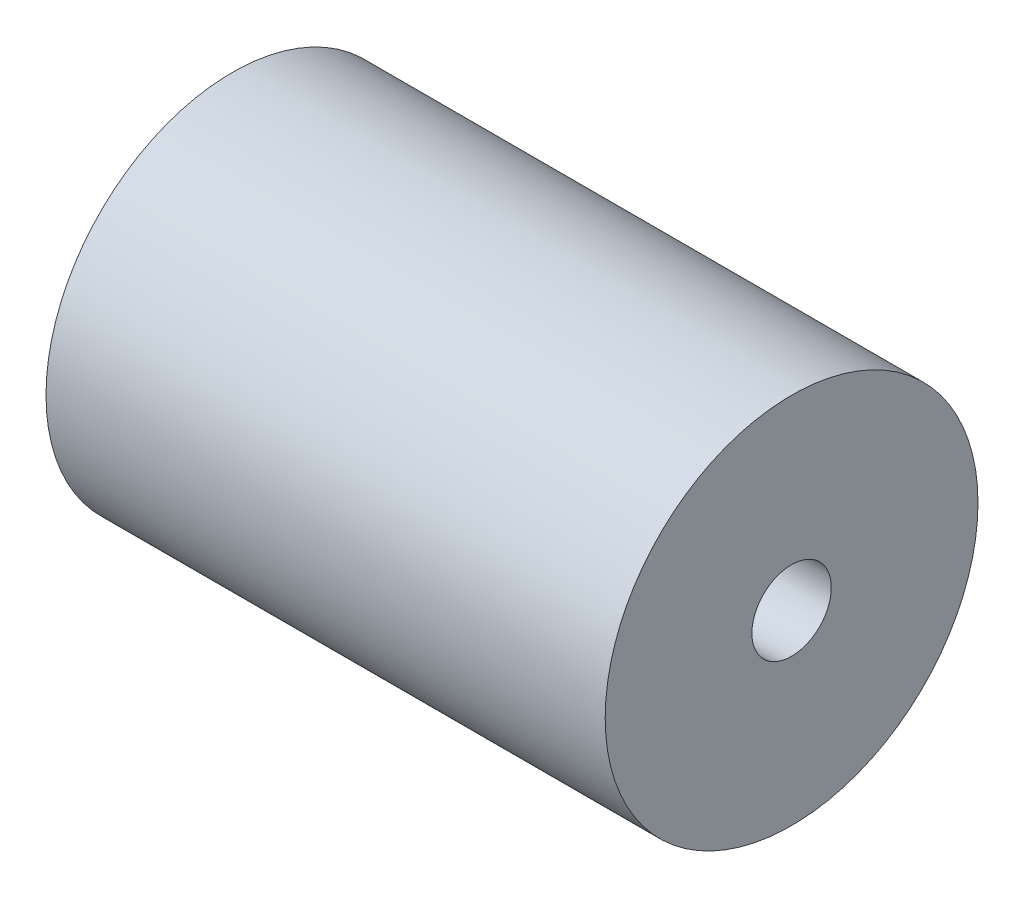
ISO-10303-21;
HEADER;
FILE_DESCRIPTION(('STEP AP214'),'2;1');
FILE_NAME('part.step','',(''),(''),'','','');
FILE_SCHEMA(('AUTOMOTIVE_DESIGN { 1 0 10303 214 1 1 1 1 }'));
ENDSEC;
DATA;
#1=APPLICATION_CONTEXT('core data for automotive mechanical design processes');
#2=APPLICATION_PROTOCOL_DEFINITION('international standard','automotive_design',2000,#1);
#3=PRODUCT_CONTEXT('',#1,'mechanical');
#4=PRODUCT('Part','Part','',(#3));
#5=PRODUCT_RELATED_PRODUCT_CATEGORY('part','',(#4));
#6=PRODUCT_DEFINITION_FORMATION('','',#4);
#7=PRODUCT_DEFINITION_CONTEXT('part definition',#1,'design');
#8=PRODUCT_DEFINITION('design','',#6,#7);
#9=PRODUCT_DEFINITION_SHAPE('','',#8);
#10=(LENGTH_UNIT() NAMED_UNIT(*) SI_UNIT(.MILLI.,.METRE.));
#11=(NAMED_UNIT(*) PLANE_ANGLE_UNIT() SI_UNIT($,.RADIAN.));
#12=(NAMED_UNIT(*) SI_UNIT($,.STERADIAN.) SOLID_ANGLE_UNIT());
#13=UNCERTAINTY_MEASURE_WITH_UNIT(LENGTH_MEASURE(1.E-05),#10,'distance_accuracy_value','');
#14=(GEOMETRIC_REPRESENTATION_CONTEXT(3) GLOBAL_UNCERTAINTY_ASSIGNED_CONTEXT((#13)) GLOBAL_UNIT_ASSIGNED_CONTEXT((#10,
#11,#12)) REPRESENTATION_CONTEXT('',''));
#15=CARTESIAN_POINT('',(0.,0.,0.));
#16=DIRECTION('',(0.,0.,1.));
#17=DIRECTION('',(1.,0.,0.));
#18=AXIS2_PLACEMENT_3D('',#15,#16,#17);
#19=CARTESIAN_POINT('',(19.05,0.,0.));
#20=DIRECTION('',(-1.,0.,0.));
#21=DIRECTION('',(0.,0.,1.));
#22=AXIS2_PLACEMENT_3D('',#19,#20,#21);
#23=CYLINDRICAL_SURFACE('',#22,6.35);
#24=CARTESIAN_POINT('',(19.05,0.,0.));
#25=DIRECTION('',(1.,0.,0.));
#26=DIRECTION('',(0.,0.,-1.));
#27=AXIS2_PLACEMENT_3D('',#24,#25,#26);
#28=CIRCLE('',#27,6.35);
#29=CARTESIAN_POINT('',(19.05,0.,-6.35));
#30=VERTEX_POINT('',#29);
#31=EDGE_CURVE('E10',#30,#30,#28,.T.);
#32=ORIENTED_EDGE('',*,*,#31,.F.);
#33=EDGE_LOOP('',(#32));
#34=FACE_BOUND('',#33,.T.);
#35=CARTESIAN_POINT('',(0.,0.,0.));
#36=DIRECTION('',(1.,0.,0.));
#37=DIRECTION('',(0.,0.,-1.));
#38=AXIS2_PLACEMENT_3D('',#35,#36,#37);
#39=CIRCLE('',#38,6.35);
#40=CARTESIAN_POINT('',(0.,0.,-6.35));
#41=VERTEX_POINT('',#40);
#42=EDGE_CURVE('E36',#41,#41,#39,.T.);
#43=ORIENTED_EDGE('',*,*,#42,.T.);
#44=EDGE_LOOP('',(#43));
#45=FACE_BOUND('',#44,.T.);
#46=ADVANCED_FACE('F33',(#34,#45),#23,.T.);
#47=CARTESIAN_POINT('',(19.05,0.,0.));
#48=DIRECTION('',(1.,0.,0.));
#49=DIRECTION('',(0.,0.,-1.));
#50=AXIS2_PLACEMENT_3D('',#47,#48,#49);
#51=PLANE('',#50);
#52=CARTESIAN_POINT('',(19.05,0.,0.));
#53=DIRECTION('',(-1.,0.,0.));
#54=DIRECTION('',(0.,0.,1.));
#55=AXIS2_PLACEMENT_3D('',#52,#53,#54);
#56=CIRCLE('',#55,1.35255);
#57=CARTESIAN_POINT('',(19.05,0.,1.35255));
#58=VERTEX_POINT('',#57);
#59=EDGE_CURVE('E43',#58,#58,#56,.T.);
#60=ORIENTED_EDGE('',*,*,#59,.T.);
#61=EDGE_LOOP('',(#60));
#62=FACE_BOUND('',#61,.T.);
#63=ORIENTED_EDGE('',*,*,#31,.T.);
#64=EDGE_LOOP('',(#63));
#65=FACE_BOUND('',#64,.T.);
#66=ADVANCED_FACE('F56',(#62,#65),#51,.T.);
#67=CARTESIAN_POINT('',(0.,0.,0.));
#68=DIRECTION('',(1.,0.,0.));
#69=DIRECTION('',(0.,0.,-1.));
#70=AXIS2_PLACEMENT_3D('',#67,#68,#69);
#71=PLANE('',#70);
#72=CARTESIAN_POINT('',(0.,0.,0.));
#73=DIRECTION('',(-1.,0.,0.));
#74=DIRECTION('',(0.,0.,1.));
#75=AXIS2_PLACEMENT_3D('',#72,#73,#74);
#76=CIRCLE('',#75,1.35254999999999);
#77=CARTESIAN_POINT('',(0.,0.,1.35254999999999));
#78=VERTEX_POINT('',#77);
#79=EDGE_CURVE('E47',#78,#78,#76,.T.);
#80=ORIENTED_EDGE('',*,*,#79,.F.);
#81=EDGE_LOOP('',(#80));
#82=FACE_BOUND('',#81,.T.);
#83=ORIENTED_EDGE('',*,*,#42,.F.);
#84=EDGE_LOOP('',(#83));
#85=FACE_BOUND('',#84,.T.);
#86=ADVANCED_FACE('F53',(#82,#85),#71,.F.);
#87=CARTESIAN_POINT('',(0.,0.,0.));
#88=DIRECTION('',(-1.,0.,0.));
#89=DIRECTION('',(0.,0.,1.));
#90=AXIS2_PLACEMENT_3D('',#87,#88,#89);
#91=CYLINDRICAL_SURFACE('',#90,1.35254999999999);
#92=ORIENTED_EDGE('',*,*,#59,.F.);
#93=EDGE_LOOP('',(#92));
#94=FACE_BOUND('',#93,.T.);
#95=ORIENTED_EDGE('',*,*,#79,.T.);
#96=EDGE_LOOP('',(#95));
#97=FACE_BOUND('',#96,.T.);
#98=ADVANCED_FACE('F51',(#94,#97),#91,.F.);
#99=CLOSED_SHELL('',(#46,#66,#86,#98));
#100=MANIFOLD_SOLID_BREP('B2',#99);
#101=ADVANCED_BREP_SHAPE_REPRESENTATION('',(#18,#100),#14);
#102=SHAPE_DEFINITION_REPRESENTATION(#9,#101);
ENDSEC;
END-ISO-10303-21;
